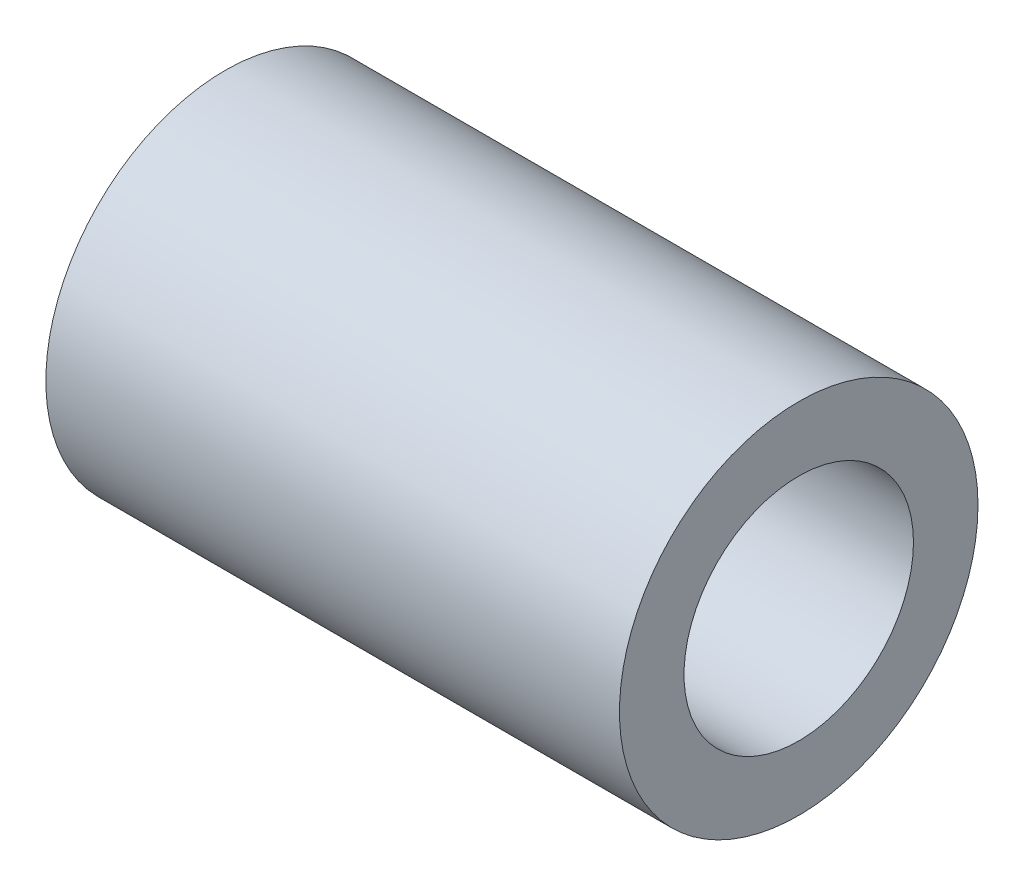
ISO-10303-21;
HEADER;
FILE_DESCRIPTION(('STEP AP214'),'2;1');
FILE_NAME('part.step','',(''),(''),'','','');
FILE_SCHEMA(('AUTOMOTIVE_DESIGN { 1 0 10303 214 1 1 1 1 }'));
ENDSEC;
DATA;
#1=APPLICATION_CONTEXT('core data for automotive mechanical design processes');
#2=APPLICATION_PROTOCOL_DEFINITION('international standard','automotive_design',2000,#1);
#3=PRODUCT_CONTEXT('',#1,'mechanical');
#4=PRODUCT('Part','Part','',(#3));
#5=PRODUCT_RELATED_PRODUCT_CATEGORY('part','',(#4));
#6=PRODUCT_DEFINITION_FORMATION('','',#4);
#7=PRODUCT_DEFINITION_CONTEXT('part definition',#1,'design');
#8=PRODUCT_DEFINITION('design','',#6,#7);
#9=PRODUCT_DEFINITION_SHAPE('','',#8);
#10=(LENGTH_UNIT() NAMED_UNIT(*) SI_UNIT(.MILLI.,.METRE.));
#11=(NAMED_UNIT(*) PLANE_ANGLE_UNIT() SI_UNIT($,.RADIAN.));
#12=(NAMED_UNIT(*) SI_UNIT($,.STERADIAN.) SOLID_ANGLE_UNIT());
#13=UNCERTAINTY_MEASURE_WITH_UNIT(LENGTH_MEASURE(1.E-05),#10,'distance_accuracy_value','');
#14=(GEOMETRIC_REPRESENTATION_CONTEXT(3) GLOBAL_UNCERTAINTY_ASSIGNED_CONTEXT((#13)) GLOBAL_UNIT_ASSIGNED_CONTEXT((#10,
#11,#12)) REPRESENTATION_CONTEXT('',''));
#15=CARTESIAN_POINT('',(0.,0.,0.));
#16=DIRECTION('',(0.,0.,1.));
#17=DIRECTION('',(1.,0.,0.));
#18=AXIS2_PLACEMENT_3D('',#15,#16,#17);
#19=CARTESIAN_POINT('',(715.,-245.,-208.539219456288));
#20=DIRECTION('',(-1.,0.,0.));
#21=DIRECTION('',(0.,0.,1.));
#22=AXIS2_PLACEMENT_3D('',#19,#20,#21);
#23=CYLINDRICAL_SURFACE('',#22,25.);
#24=CARTESIAN_POINT('',(715.,-245.,-208.539219456288));
#25=DIRECTION('',(1.,0.,0.));
#26=DIRECTION('',(0.,0.,-1.));
#27=AXIS2_PLACEMENT_3D('',#24,#25,#26);
#28=CIRCLE('',#27,25.);
#29=CARTESIAN_POINT('',(715.,-245.,-233.539219456289));
#30=VERTEX_POINT('',#29);
#31=EDGE_CURVE('E42',#30,#30,#28,.T.);
#32=ORIENTED_EDGE('',*,*,#31,.F.);
#33=EDGE_LOOP('',(#32));
#34=FACE_BOUND('',#33,.T.);
#35=CARTESIAN_POINT('',(635.,-245.,-208.539219456288));
#36=DIRECTION('',(1.,0.,0.));
#37=DIRECTION('',(0.,0.,-1.));
#38=AXIS2_PLACEMENT_3D('',#35,#36,#37);
#39=CIRCLE('',#38,25.);
#40=CARTESIAN_POINT('',(635.,-245.,-233.539219456289));
#41=VERTEX_POINT('',#40);
#42=EDGE_CURVE('E48',#41,#41,#39,.T.);
#43=ORIENTED_EDGE('',*,*,#42,.T.);
#44=EDGE_LOOP('',(#43));
#45=FACE_BOUND('',#44,.T.);
#46=ADVANCED_FACE('F35',(#34,#45),#23,.T.);
#47=CARTESIAN_POINT('',(715.,-245.,-208.539219456288));
#48=DIRECTION('',(-1.,0.,0.));
#49=DIRECTION('',(0.,0.,1.));
#50=AXIS2_PLACEMENT_3D('',#47,#48,#49);
#51=CYLINDRICAL_SURFACE('',#50,16.);
#52=CARTESIAN_POINT('',(715.,-245.,-208.539219456288));
#53=DIRECTION('',(1.,0.,0.));
#54=DIRECTION('',(0.,0.,-1.));
#55=AXIS2_PLACEMENT_3D('',#52,#53,#54);
#56=CIRCLE('',#55,16.);
#57=CARTESIAN_POINT('',(715.,-245.,-224.539219456289));
#58=VERTEX_POINT('',#57);
#59=EDGE_CURVE('E10',#58,#58,#56,.T.);
#60=ORIENTED_EDGE('',*,*,#59,.T.);
#61=EDGE_LOOP('',(#60));
#62=FACE_BOUND('',#61,.T.);
#63=CARTESIAN_POINT('',(635.,-245.,-208.539219456288));
#64=DIRECTION('',(1.,0.,0.));
#65=DIRECTION('',(0.,0.,-1.));
#66=AXIS2_PLACEMENT_3D('',#63,#64,#65);
#67=CIRCLE('',#66,16.);
#68=CARTESIAN_POINT('',(635.,-245.,-224.539219456289));
#69=VERTEX_POINT('',#68);
#70=EDGE_CURVE('E38',#69,#69,#67,.T.);
#71=ORIENTED_EDGE('',*,*,#70,.F.);
#72=EDGE_LOOP('',(#71));
#73=FACE_BOUND('',#72,.T.);
#74=ADVANCED_FACE('F57',(#62,#73),#51,.F.);
#75=CARTESIAN_POINT('',(715.,0.,0.));
#76=DIRECTION('',(1.,0.,0.));
#77=DIRECTION('',(0.,0.,-1.));
#78=AXIS2_PLACEMENT_3D('',#75,#76,#77);
#79=PLANE('',#78);
#80=ORIENTED_EDGE('',*,*,#31,.T.);
#81=EDGE_LOOP('',(#80));
#82=FACE_BOUND('',#81,.T.);
#83=ORIENTED_EDGE('',*,*,#59,.F.);
#84=EDGE_LOOP('',(#83));
#85=FACE_BOUND('',#84,.T.);
#86=ADVANCED_FACE('F59',(#82,#85),#79,.T.);
#87=CARTESIAN_POINT('',(635.,0.,0.));
#88=DIRECTION('',(1.,0.,0.));
#89=DIRECTION('',(0.,0.,-1.));
#90=AXIS2_PLACEMENT_3D('',#87,#88,#89);
#91=PLANE('',#90);
#92=ORIENTED_EDGE('',*,*,#42,.F.);
#93=EDGE_LOOP('',(#92));
#94=FACE_BOUND('',#93,.T.);
#95=ORIENTED_EDGE('',*,*,#70,.T.);
#96=EDGE_LOOP('',(#95));
#97=FACE_BOUND('',#96,.T.);
#98=ADVANCED_FACE('F55',(#94,#97),#91,.F.);
#99=CLOSED_SHELL('',(#46,#74,#86,#98));
#100=MANIFOLD_SOLID_BREP('B2',#99);
#101=ADVANCED_BREP_SHAPE_REPRESENTATION('',(#18,#100),#14);
#102=SHAPE_DEFINITION_REPRESENTATION(#9,#101);
ENDSEC;
END-ISO-10303-21;
